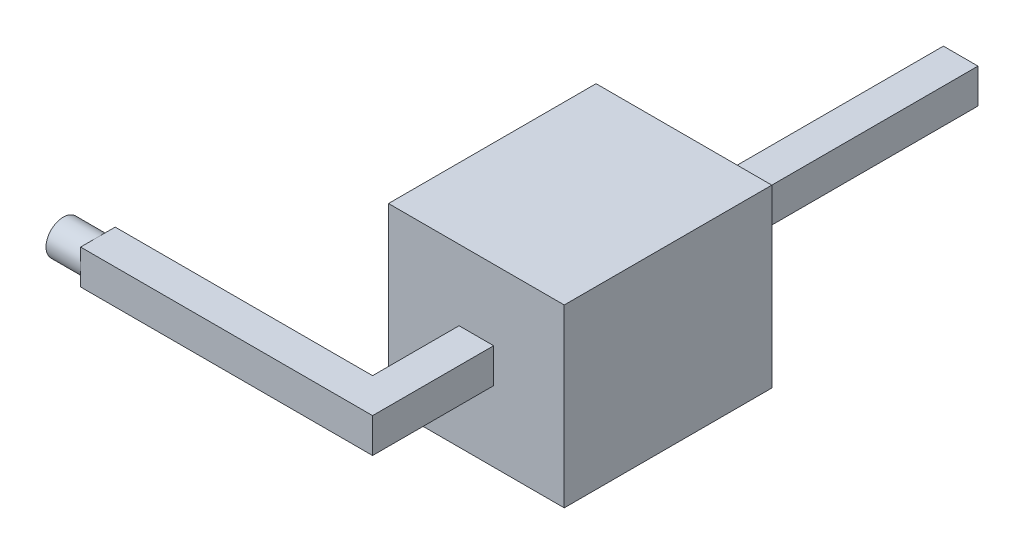
ISO-10303-21;
HEADER;
FILE_DESCRIPTION(('STEP AP214'),'2;1');
FILE_NAME('part.step','',(''),(''),'','','');
FILE_SCHEMA(('AUTOMOTIVE_DESIGN { 1 0 10303 214 1 1 1 1 }'));
ENDSEC;
DATA;
#1=APPLICATION_CONTEXT('core data for automotive mechanical design processes');
#2=APPLICATION_PROTOCOL_DEFINITION('international standard','automotive_design',2000,#1);
#3=PRODUCT_CONTEXT('',#1,'mechanical');
#4=PRODUCT('Part','Part','',(#3));
#5=PRODUCT_RELATED_PRODUCT_CATEGORY('part','',(#4));
#6=PRODUCT_DEFINITION_FORMATION('','',#4);
#7=PRODUCT_DEFINITION_CONTEXT('part definition',#1,'design');
#8=PRODUCT_DEFINITION('design','',#6,#7);
#9=PRODUCT_DEFINITION_SHAPE('','',#8);
#10=(LENGTH_UNIT() NAMED_UNIT(*) SI_UNIT(.MILLI.,.METRE.));
#11=(NAMED_UNIT(*) PLANE_ANGLE_UNIT() SI_UNIT($,.RADIAN.));
#12=(NAMED_UNIT(*) SI_UNIT($,.STERADIAN.) SOLID_ANGLE_UNIT());
#13=UNCERTAINTY_MEASURE_WITH_UNIT(LENGTH_MEASURE(1.E-05),#10,'distance_accuracy_value','');
#14=(GEOMETRIC_REPRESENTATION_CONTEXT(3) GLOBAL_UNCERTAINTY_ASSIGNED_CONTEXT((#13)) GLOBAL_UNIT_ASSIGNED_CONTEXT((#10,
#11,#12)) REPRESENTATION_CONTEXT('',''));
#15=CARTESIAN_POINT('',(0.,0.,0.));
#16=DIRECTION('',(0.,0.,1.));
#17=DIRECTION('',(1.,0.,0.));
#18=AXIS2_PLACEMENT_3D('',#15,#16,#17);
#19=CARTESIAN_POINT('',(0.,0.5,0.));
#20=DIRECTION('',(0.,-1.,0.));
#21=DIRECTION('',(0.,0.,-1.));
#22=AXIS2_PLACEMENT_3D('',#19,#20,#21);
#23=PLANE('',#22);
#24=DIRECTION('',(0.,0.,-1.));
#25=VECTOR('',#24,1.);
#26=CARTESIAN_POINT('',(0.5,0.5,0.));
#27=LINE('',#26,#25);
#28=CARTESIAN_POINT('',(0.5,0.5,0.));
#29=VERTEX_POINT('',#28);
#30=CARTESIAN_POINT('',(0.5,0.5,-0.25));
#31=VERTEX_POINT('',#30);
#32=EDGE_CURVE('E175',#29,#31,#27,.T.);
#33=ORIENTED_EDGE('',*,*,#32,.F.);
#34=DIRECTION('',(1.,0.,0.));
#35=VECTOR('',#34,1.);
#36=CARTESIAN_POINT('',(0.,0.5,0.));
#37=LINE('',#36,#35);
#38=CARTESIAN_POINT('',(4.72,0.5,0.));
#39=VERTEX_POINT('',#38);
#40=EDGE_CURVE('E180',#29,#39,#37,.T.);
#41=ORIENTED_EDGE('',*,*,#40,.T.);
#42=DIRECTION('',(0.,0.,-1.));
#43=VECTOR('',#42,1.);
#44=CARTESIAN_POINT('',(4.72,0.5,0.));
#45=LINE('',#44,#43);
#46=CARTESIAN_POINT('',(4.72,0.5,-1.75000000000002));
#47=VERTEX_POINT('',#46);
#48=EDGE_CURVE('E232',#39,#47,#45,.T.);
#49=ORIENTED_EDGE('',*,*,#48,.T.);
#50=DIRECTION('',(1.,0.,0.));
#51=VECTOR('',#50,1.);
#52=CARTESIAN_POINT('',(0.,0.5,-1.75));
#53=LINE('',#52,#51);
#54=CARTESIAN_POINT('',(4.22,0.5,-1.75000000000002));
#55=VERTEX_POINT('',#54);
#56=EDGE_CURVE('E226',#55,#47,#53,.T.);
#57=ORIENTED_EDGE('',*,*,#56,.F.);
#58=DIRECTION('',(0.,0.,1.));
#59=VECTOR('',#58,1.);
#60=CARTESIAN_POINT('',(4.22,0.5,-0.5));
#61=LINE('',#60,#59);
#62=CARTESIAN_POINT('',(4.22,0.5,-0.5));
#63=VERTEX_POINT('',#62);
#64=EDGE_CURVE('E237',#55,#63,#61,.T.);
#65=ORIENTED_EDGE('',*,*,#64,.T.);
#66=DIRECTION('',(-1.,0.,0.));
#67=VECTOR('',#66,1.);
#68=CARTESIAN_POINT('',(0.,0.5,-0.500000000000001));
#69=LINE('',#68,#67);
#70=CARTESIAN_POINT('',(0.5,0.5,-0.500000000000001));
#71=VERTEX_POINT('',#70);
#72=EDGE_CURVE('E240',#63,#71,#69,.T.);
#73=ORIENTED_EDGE('',*,*,#72,.T.);
#74=EDGE_CURVE('E181',#31,#71,#27,.T.);
#75=ORIENTED_EDGE('',*,*,#74,.F.);
#76=EDGE_LOOP('',(#33,#41,#49,#57,#65,#73,#75));
#77=FACE_BOUND('',#76,.T.);
#78=ADVANCED_FACE('F36',(#77),#23,.F.);
#79=CARTESIAN_POINT('',(0.,0.,0.));
#80=DIRECTION('',(0.,-1.,0.));
#81=DIRECTION('',(0.,0.,-1.));
#82=AXIS2_PLACEMENT_3D('',#79,#80,#81);
#83=PLANE('',#82);
#84=DIRECTION('',(1.,0.,0.));
#85=VECTOR('',#84,1.);
#86=CARTESIAN_POINT('',(0.,0.,0.));
#87=LINE('',#86,#85);
#88=CARTESIAN_POINT('',(0.5,0.,0.));
#89=VERTEX_POINT('',#88);
#90=CARTESIAN_POINT('',(4.72,0.,0.));
#91=VERTEX_POINT('',#90);
#92=EDGE_CURVE('E228',#89,#91,#87,.T.);
#93=ORIENTED_EDGE('',*,*,#92,.F.);
#94=DIRECTION('',(0.,0.,-1.));
#95=VECTOR('',#94,1.);
#96=CARTESIAN_POINT('',(0.5,0.,0.));
#97=LINE('',#96,#95);
#98=CARTESIAN_POINT('',(0.5,0.,-0.25));
#99=VERTEX_POINT('',#98);
#100=EDGE_CURVE('E158',#89,#99,#97,.T.);
#101=ORIENTED_EDGE('',*,*,#100,.T.);
#102=CARTESIAN_POINT('',(0.5,0.,-0.500000000000001));
#103=VERTEX_POINT('',#102);
#104=EDGE_CURVE('E176',#99,#103,#97,.T.);
#105=ORIENTED_EDGE('',*,*,#104,.T.);
#106=DIRECTION('',(-1.,0.,0.));
#107=VECTOR('',#106,1.);
#108=CARTESIAN_POINT('',(0.,0.,-0.500000000000001));
#109=LINE('',#108,#107);
#110=CARTESIAN_POINT('',(4.22,0.,-0.5));
#111=VERTEX_POINT('',#110);
#112=EDGE_CURVE('E231',#111,#103,#109,.T.);
#113=ORIENTED_EDGE('',*,*,#112,.F.);
#114=DIRECTION('',(0.,0.,1.));
#115=VECTOR('',#114,1.);
#116=CARTESIAN_POINT('',(4.22,0.,-0.5));
#117=LINE('',#116,#115);
#118=CARTESIAN_POINT('',(4.22,0.,-1.75000000000002));
#119=VERTEX_POINT('',#118);
#120=EDGE_CURVE('E251',#119,#111,#117,.T.);
#121=ORIENTED_EDGE('',*,*,#120,.F.);
#122=DIRECTION('',(1.,0.,0.));
#123=VECTOR('',#122,1.);
#124=CARTESIAN_POINT('',(0.,0.,-1.75));
#125=LINE('',#124,#123);
#126=CARTESIAN_POINT('',(4.72,0.,-1.75000000000001));
#127=VERTEX_POINT('',#126);
#128=EDGE_CURVE('E269',#119,#127,#125,.T.);
#129=ORIENTED_EDGE('',*,*,#128,.T.);
#130=DIRECTION('',(0.,0.,-1.));
#131=VECTOR('',#130,1.);
#132=CARTESIAN_POINT('',(4.72,0.,-3.64997651924631));
#133=LINE('',#132,#131);
#134=EDGE_CURVE('E246',#91,#127,#133,.T.);
#135=ORIENTED_EDGE('',*,*,#134,.F.);
#136=EDGE_LOOP('',(#93,#101,#105,#113,#121,#129,#135));
#137=FACE_BOUND('',#136,.T.);
#138=ADVANCED_FACE('F281',(#137),#83,.T.);
#139=CARTESIAN_POINT('',(0.,0.5,0.));
#140=DIRECTION('',(0.,0.,-1.));
#141=DIRECTION('',(-1.,0.,0.));
#142=AXIS2_PLACEMENT_3D('',#139,#140,#141);
#143=PLANE('',#142);
#144=DIRECTION('',(0.,1.,0.));
#145=VECTOR('',#144,1.);
#146=CARTESIAN_POINT('',(0.5,0.5,0.));
#147=LINE('',#146,#145);
#148=CARTESIAN_POINT('',(0.5,0.25,0.));
#149=VERTEX_POINT('',#148);
#150=EDGE_CURVE('E153',#89,#149,#147,.T.);
#151=ORIENTED_EDGE('',*,*,#150,.F.);
#152=ORIENTED_EDGE('',*,*,#92,.T.);
#153=DIRECTION('',(0.,-1.,0.));
#154=VECTOR('',#153,1.);
#155=CARTESIAN_POINT('',(4.72,0.5,0.));
#156=LINE('',#155,#154);
#157=EDGE_CURVE('E264',#39,#91,#156,.T.);
#158=ORIENTED_EDGE('',*,*,#157,.F.);
#159=ORIENTED_EDGE('',*,*,#40,.F.);
#160=EDGE_CURVE('E163',#149,#29,#147,.T.);
#161=ORIENTED_EDGE('',*,*,#160,.F.);
#162=EDGE_LOOP('',(#151,#152,#158,#159,#161));
#163=FACE_BOUND('',#162,.T.);
#164=ADVANCED_FACE('F178',(#163),#143,.F.);
#165=CARTESIAN_POINT('',(0.,0.5,-0.500000000000001));
#166=DIRECTION('',(0.,0.,1.));
#167=DIRECTION('',(1.,0.,0.));
#168=AXIS2_PLACEMENT_3D('',#165,#166,#167);
#169=PLANE('',#168);
#170=DIRECTION('',(0.,-1.,0.));
#171=VECTOR('',#170,1.);
#172=CARTESIAN_POINT('',(0.5,0.5,-0.500000000000001));
#173=LINE('',#172,#171);
#174=CARTESIAN_POINT('',(0.5,0.25,-0.5));
#175=VERTEX_POINT('',#174);
#176=EDGE_CURVE('E12',#71,#175,#173,.T.);
#177=ORIENTED_EDGE('',*,*,#176,.F.);
#178=ORIENTED_EDGE('',*,*,#72,.F.);
#179=DIRECTION('',(0.,-1.,0.));
#180=VECTOR('',#179,1.);
#181=CARTESIAN_POINT('',(4.22,0.5,-0.5));
#182=LINE('',#181,#180);
#183=EDGE_CURVE('E243',#63,#111,#182,.T.);
#184=ORIENTED_EDGE('',*,*,#183,.T.);
#185=ORIENTED_EDGE('',*,*,#112,.T.);
#186=EDGE_CURVE('E40',#175,#103,#173,.T.);
#187=ORIENTED_EDGE('',*,*,#186,.F.);
#188=EDGE_LOOP('',(#177,#178,#184,#185,#187));
#189=FACE_BOUND('',#188,.T.);
#190=ADVANCED_FACE('F282',(#189),#169,.F.);
#191=CARTESIAN_POINT('',(4.72,0.5,-3.64997651924631));
#192=DIRECTION('',(-1.,0.,0.));
#193=DIRECTION('',(0.,0.,1.));
#194=AXIS2_PLACEMENT_3D('',#191,#192,#193);
#195=PLANE('',#194);
#196=DIRECTION('',(0.,-1.,0.));
#197=VECTOR('',#196,1.);
#198=CARTESIAN_POINT('',(4.72,0.5,-1.75000000000002));
#199=LINE('',#198,#197);
#200=EDGE_CURVE('E224',#47,#127,#199,.T.);
#201=ORIENTED_EDGE('',*,*,#200,.F.);
#202=ORIENTED_EDGE('',*,*,#48,.F.);
#203=ORIENTED_EDGE('',*,*,#157,.T.);
#204=ORIENTED_EDGE('',*,*,#134,.T.);
#205=EDGE_LOOP('',(#201,#202,#203,#204));
#206=FACE_BOUND('',#205,.T.);
#207=ADVANCED_FACE('F296',(#206),#195,.F.);
#208=CARTESIAN_POINT('',(4.22,0.5,-0.5));
#209=DIRECTION('',(1.,0.,0.));
#210=DIRECTION('',(0.,0.,-1.));
#211=AXIS2_PLACEMENT_3D('',#208,#209,#210);
#212=PLANE('',#211);
#213=DIRECTION('',(0.,1.,0.));
#214=VECTOR('',#213,1.);
#215=CARTESIAN_POINT('',(4.22,0.5,-1.75000000000002));
#216=LINE('',#215,#214);
#217=EDGE_CURVE('E222',#119,#55,#216,.T.);
#218=ORIENTED_EDGE('',*,*,#217,.F.);
#219=ORIENTED_EDGE('',*,*,#120,.T.);
#220=ORIENTED_EDGE('',*,*,#183,.F.);
#221=ORIENTED_EDGE('',*,*,#64,.F.);
#222=EDGE_LOOP('',(#218,#219,#220,#221));
#223=FACE_BOUND('',#222,.T.);
#224=ADVANCED_FACE('F288',(#223),#212,.F.);
#225=CARTESIAN_POINT('',(0.,0.,-1.75));
#226=DIRECTION('',(0.,0.,-1.));
#227=DIRECTION('',(-1.,0.,0.));
#228=AXIS2_PLACEMENT_3D('',#225,#226,#227);
#229=PLANE('',#228);
#230=DIRECTION('',(0.,-1.,0.));
#231=VECTOR('',#230,1.);
#232=CARTESIAN_POINT('',(5.74000000000003,-1.02,-1.75000000000002));
#233=LINE('',#232,#231);
#234=CARTESIAN_POINT('',(5.74000000000003,1.52,-1.75000000000002));
#235=VERTEX_POINT('',#234);
#236=CARTESIAN_POINT('',(5.74000000000003,-1.02,-1.75000000000002));
#237=VERTEX_POINT('',#236);
#238=EDGE_CURVE('E185',#235,#237,#233,.T.);
#239=ORIENTED_EDGE('',*,*,#238,.F.);
#240=DIRECTION('',(1.,0.,0.));
#241=VECTOR('',#240,1.);
#242=CARTESIAN_POINT('',(3.20000000000003,1.52,-1.75000000000001));
#243=LINE('',#242,#241);
#244=CARTESIAN_POINT('',(3.20000000000003,1.52,-1.75000000000001));
#245=VERTEX_POINT('',#244);
#246=EDGE_CURVE('E195',#245,#235,#243,.T.);
#247=ORIENTED_EDGE('',*,*,#246,.F.);
#248=DIRECTION('',(0.,1.,0.));
#249=VECTOR('',#248,1.);
#250=CARTESIAN_POINT('',(3.20000000000003,-1.02,-1.75000000000001));
#251=LINE('',#250,#249);
#252=CARTESIAN_POINT('',(3.20000000000003,-1.02,-1.75000000000001));
#253=VERTEX_POINT('',#252);
#254=EDGE_CURVE('E192',#253,#245,#251,.T.);
#255=ORIENTED_EDGE('',*,*,#254,.F.);
#256=DIRECTION('',(-1.,0.,0.));
#257=VECTOR('',#256,1.);
#258=CARTESIAN_POINT('',(3.20000000000003,-1.02,-1.75000000000001));
#259=LINE('',#258,#257);
#260=EDGE_CURVE('E188',#237,#253,#259,.T.);
#261=ORIENTED_EDGE('',*,*,#260,.F.);
#262=EDGE_LOOP('',(#239,#247,#255,#261));
#263=FACE_BOUND('',#262,.T.);
#264=ORIENTED_EDGE('',*,*,#217,.T.);
#265=ORIENTED_EDGE('',*,*,#56,.T.);
#266=ORIENTED_EDGE('',*,*,#200,.T.);
#267=ORIENTED_EDGE('',*,*,#128,.F.);
#268=EDGE_LOOP('',(#264,#265,#266,#267));
#269=FACE_BOUND('',#268,.T.);
#270=ADVANCED_FACE('F291',(#263,#269),#229,.F.);
#271=CARTESIAN_POINT('',(0.,0.,-4.75));
#272=DIRECTION('',(0.,0.,-1.));
#273=DIRECTION('',(-1.,0.,0.));
#274=AXIS2_PLACEMENT_3D('',#271,#272,#273);
#275=PLANE('',#274);
#276=DIRECTION('',(0.,-1.,0.));
#277=VECTOR('',#276,1.);
#278=CARTESIAN_POINT('',(5.74000000000002,-1.02,-4.75000000000002));
#279=LINE('',#278,#277);
#280=CARTESIAN_POINT('',(5.74000000000002,1.52,-4.75000000000002));
#281=VERTEX_POINT('',#280);
#282=CARTESIAN_POINT('',(5.74000000000002,-1.02,-4.75000000000002));
#283=VERTEX_POINT('',#282);
#284=EDGE_CURVE('E162',#281,#283,#279,.T.);
#285=ORIENTED_EDGE('',*,*,#284,.T.);
#286=DIRECTION('',(-1.,0.,0.));
#287=VECTOR('',#286,1.);
#288=CARTESIAN_POINT('',(3.20000000000001,-1.02,-4.75000000000001));
#289=LINE('',#288,#287);
#290=CARTESIAN_POINT('',(3.20000000000001,-1.02,-4.75000000000001));
#291=VERTEX_POINT('',#290);
#292=EDGE_CURVE('E201',#283,#291,#289,.T.);
#293=ORIENTED_EDGE('',*,*,#292,.T.);
#294=DIRECTION('',(0.,1.,0.));
#295=VECTOR('',#294,1.);
#296=CARTESIAN_POINT('',(3.20000000000001,-1.02,-4.75000000000001));
#297=LINE('',#296,#295);
#298=CARTESIAN_POINT('',(3.20000000000001,1.52,-4.75000000000001));
#299=VERTEX_POINT('',#298);
#300=EDGE_CURVE('E204',#291,#299,#297,.T.);
#301=ORIENTED_EDGE('',*,*,#300,.T.);
#302=DIRECTION('',(1.,0.,0.));
#303=VECTOR('',#302,1.);
#304=CARTESIAN_POINT('',(3.20000000000001,1.52,-4.75000000000001));
#305=LINE('',#304,#303);
#306=EDGE_CURVE('E189',#299,#281,#305,.T.);
#307=ORIENTED_EDGE('',*,*,#306,.T.);
#308=EDGE_LOOP('',(#285,#293,#301,#307));
#309=FACE_BOUND('',#308,.T.);
#310=DIRECTION('',(1.,0.,0.));
#311=VECTOR('',#310,1.);
#312=CARTESIAN_POINT('',(0.,0.5,-4.75));
#313=LINE('',#312,#311);
#314=CARTESIAN_POINT('',(4.22,0.5,-4.75000000000001));
#315=VERTEX_POINT('',#314);
#316=CARTESIAN_POINT('',(4.72,0.5,-4.75000000000001));
#317=VERTEX_POINT('',#316);
#318=EDGE_CURVE('E220',#315,#317,#313,.T.);
#319=ORIENTED_EDGE('',*,*,#318,.F.);
#320=DIRECTION('',(0.,1.,0.));
#321=VECTOR('',#320,1.);
#322=CARTESIAN_POINT('',(4.22,0.5,-4.75000000000002));
#323=LINE('',#322,#321);
#324=CARTESIAN_POINT('',(4.22,0.,-4.75000000000001));
#325=VERTEX_POINT('',#324);
#326=EDGE_CURVE('E59',#325,#315,#323,.T.);
#327=ORIENTED_EDGE('',*,*,#326,.F.);
#328=DIRECTION('',(1.,0.,0.));
#329=VECTOR('',#328,1.);
#330=CARTESIAN_POINT('',(0.,0.,-4.75));
#331=LINE('',#330,#329);
#332=CARTESIAN_POINT('',(4.72,0.,-4.75000000000002));
#333=VERTEX_POINT('',#332);
#334=EDGE_CURVE('E267',#325,#333,#331,.T.);
#335=ORIENTED_EDGE('',*,*,#334,.T.);
#336=DIRECTION('',(0.,-1.,0.));
#337=VECTOR('',#336,1.);
#338=CARTESIAN_POINT('',(4.72,0.5,-4.75000000000002));
#339=LINE('',#338,#337);
#340=EDGE_CURVE('E217',#317,#333,#339,.T.);
#341=ORIENTED_EDGE('',*,*,#340,.F.);
#342=EDGE_LOOP('',(#319,#327,#335,#341));
#343=FACE_BOUND('',#342,.T.);
#344=ADVANCED_FACE('F336',(#309,#343),#275,.T.);
#345=CARTESIAN_POINT('',(5.74000000000003,-1.02,-1.75000000000002));
#346=DIRECTION('',(1.,0.,0.));
#347=DIRECTION('',(0.,0.,-1.));
#348=AXIS2_PLACEMENT_3D('',#345,#346,#347);
#349=PLANE('',#348);
#350=ORIENTED_EDGE('',*,*,#284,.F.);
#351=DIRECTION('',(0.,0.,-1.));
#352=VECTOR('',#351,1.);
#353=CARTESIAN_POINT('',(5.74000000000003,1.52,-1.75000000000002));
#354=LINE('',#353,#352);
#355=EDGE_CURVE('E209',#235,#281,#354,.T.);
#356=ORIENTED_EDGE('',*,*,#355,.F.);
#357=ORIENTED_EDGE('',*,*,#238,.T.);
#358=DIRECTION('',(0.,0.,-1.));
#359=VECTOR('',#358,1.);
#360=CARTESIAN_POINT('',(5.74000000000003,-1.02,-1.75000000000002));
#361=LINE('',#360,#359);
#362=EDGE_CURVE('E198',#237,#283,#361,.T.);
#363=ORIENTED_EDGE('',*,*,#362,.T.);
#364=EDGE_LOOP('',(#350,#356,#357,#363));
#365=FACE_BOUND('',#364,.T.);
#366=ADVANCED_FACE('F428',(#365),#349,.T.);
#367=CARTESIAN_POINT('',(3.20000000000003,1.52,-1.75000000000001));
#368=DIRECTION('',(0.,1.,0.));
#369=DIRECTION('',(-1.,0.,0.));
#370=AXIS2_PLACEMENT_3D('',#367,#368,#369);
#371=PLANE('',#370);
#372=ORIENTED_EDGE('',*,*,#306,.F.);
#373=DIRECTION('',(0.,0.,-1.));
#374=VECTOR('',#373,1.);
#375=CARTESIAN_POINT('',(3.20000000000003,1.52,-1.75000000000001));
#376=LINE('',#375,#374);
#377=EDGE_CURVE('E211',#245,#299,#376,.T.);
#378=ORIENTED_EDGE('',*,*,#377,.F.);
#379=ORIENTED_EDGE('',*,*,#246,.T.);
#380=ORIENTED_EDGE('',*,*,#355,.T.);
#381=EDGE_LOOP('',(#372,#378,#379,#380));
#382=FACE_BOUND('',#381,.T.);
#383=ADVANCED_FACE('F430',(#382),#371,.T.);
#384=CARTESIAN_POINT('',(3.20000000000003,-1.02,-1.75000000000001));
#385=DIRECTION('',(-1.,0.,0.));
#386=DIRECTION('',(0.,0.,1.));
#387=AXIS2_PLACEMENT_3D('',#384,#385,#386);
#388=PLANE('',#387);
#389=ORIENTED_EDGE('',*,*,#300,.F.);
#390=DIRECTION('',(0.,0.,-1.));
#391=VECTOR('',#390,1.);
#392=CARTESIAN_POINT('',(3.20000000000003,-1.02,-1.75000000000001));
#393=LINE('',#392,#391);
#394=EDGE_CURVE('E213',#253,#291,#393,.T.);
#395=ORIENTED_EDGE('',*,*,#394,.F.);
#396=ORIENTED_EDGE('',*,*,#254,.T.);
#397=ORIENTED_EDGE('',*,*,#377,.T.);
#398=EDGE_LOOP('',(#389,#395,#396,#397));
#399=FACE_BOUND('',#398,.T.);
#400=ADVANCED_FACE('F433',(#399),#388,.T.);
#401=CARTESIAN_POINT('',(3.20000000000003,-1.02,-1.75000000000001));
#402=DIRECTION('',(0.,-1.,0.));
#403=DIRECTION('',(1.,0.,0.));
#404=AXIS2_PLACEMENT_3D('',#401,#402,#403);
#405=PLANE('',#404);
#406=ORIENTED_EDGE('',*,*,#292,.F.);
#407=ORIENTED_EDGE('',*,*,#362,.F.);
#408=ORIENTED_EDGE('',*,*,#260,.T.);
#409=ORIENTED_EDGE('',*,*,#394,.T.);
#410=EDGE_LOOP('',(#406,#407,#408,#409));
#411=FACE_BOUND('',#410,.T.);
#412=ADVANCED_FACE('F328',(#411),#405,.T.);
#413=CARTESIAN_POINT('',(4.72,0.5,-8.75));
#414=DIRECTION('',(0.,0.,1.));
#415=DIRECTION('',(1.,0.,0.));
#416=AXIS2_PLACEMENT_3D('',#413,#414,#415);
#417=PLANE('',#416);
#418=DIRECTION('',(-1.,0.,0.));
#419=VECTOR('',#418,1.);
#420=CARTESIAN_POINT('',(4.72,0.,-8.75));
#421=LINE('',#420,#419);
#422=CARTESIAN_POINT('',(4.72,0.,-8.75));
#423=VERTEX_POINT('',#422);
#424=CARTESIAN_POINT('',(4.22,0.,-8.75));
#425=VERTEX_POINT('',#424);
#426=EDGE_CURVE('E249',#423,#425,#421,.T.);
#427=ORIENTED_EDGE('',*,*,#426,.T.);
#428=DIRECTION('',(0.,-1.,0.));
#429=VECTOR('',#428,1.);
#430=CARTESIAN_POINT('',(4.22,0.5,-8.75));
#431=LINE('',#430,#429);
#432=CARTESIAN_POINT('',(4.22,0.5,-8.75));
#433=VERTEX_POINT('',#432);
#434=EDGE_CURVE('E258',#433,#425,#431,.T.);
#435=ORIENTED_EDGE('',*,*,#434,.F.);
#436=DIRECTION('',(-1.,0.,0.));
#437=VECTOR('',#436,1.);
#438=CARTESIAN_POINT('',(4.72,0.5,-8.75));
#439=LINE('',#438,#437);
#440=CARTESIAN_POINT('',(4.72,0.5,-8.75));
#441=VERTEX_POINT('',#440);
#442=EDGE_CURVE('E235',#441,#433,#439,.T.);
#443=ORIENTED_EDGE('',*,*,#442,.F.);
#444=DIRECTION('',(0.,-1.,0.));
#445=VECTOR('',#444,1.);
#446=CARTESIAN_POINT('',(4.72,0.5,-8.75));
#447=LINE('',#446,#445);
#448=EDGE_CURVE('E261',#441,#423,#447,.T.);
#449=ORIENTED_EDGE('',*,*,#448,.T.);
#450=EDGE_LOOP('',(#427,#435,#443,#449));
#451=FACE_BOUND('',#450,.T.);
#452=ADVANCED_FACE('F321',(#451),#417,.F.);
#453=EDGE_CURVE('E238',#433,#315,#61,.T.);
#454=ORIENTED_EDGE('',*,*,#453,.T.);
#455=ORIENTED_EDGE('',*,*,#318,.T.);
#456=EDGE_CURVE('E230',#317,#441,#45,.T.);
#457=ORIENTED_EDGE('',*,*,#456,.T.);
#458=ORIENTED_EDGE('',*,*,#442,.T.);
#459=EDGE_LOOP('',(#454,#455,#457,#458));
#460=FACE_BOUND('',#459,.T.);
#461=ADVANCED_FACE('F312',(#460),#23,.F.);
#462=ORIENTED_EDGE('',*,*,#334,.F.);
#463=EDGE_CURVE('E252',#425,#325,#117,.T.);
#464=ORIENTED_EDGE('',*,*,#463,.F.);
#465=ORIENTED_EDGE('',*,*,#426,.F.);
#466=EDGE_CURVE('E245',#333,#423,#133,.T.);
#467=ORIENTED_EDGE('',*,*,#466,.F.);
#468=EDGE_LOOP('',(#462,#464,#465,#467));
#469=FACE_BOUND('',#468,.T.);
#470=ADVANCED_FACE('F318',(#469),#83,.T.);
#471=ORIENTED_EDGE('',*,*,#463,.T.);
#472=ORIENTED_EDGE('',*,*,#326,.T.);
#473=ORIENTED_EDGE('',*,*,#453,.F.);
#474=ORIENTED_EDGE('',*,*,#434,.T.);
#475=EDGE_LOOP('',(#471,#472,#473,#474));
#476=FACE_BOUND('',#475,.T.);
#477=ADVANCED_FACE('F304',(#476),#212,.F.);
#478=ORIENTED_EDGE('',*,*,#456,.F.);
#479=ORIENTED_EDGE('',*,*,#340,.T.);
#480=ORIENTED_EDGE('',*,*,#466,.T.);
#481=ORIENTED_EDGE('',*,*,#448,.F.);
#482=EDGE_LOOP('',(#478,#479,#480,#481));
#483=FACE_BOUND('',#482,.T.);
#484=ADVANCED_FACE('F299',(#483),#195,.F.);
#485=CARTESIAN_POINT('',(0.5,0.25,-4.375));
#486=DIRECTION('',(-1.,0.,0.));
#487=DIRECTION('',(0.,0.,1.));
#488=AXIS2_PLACEMENT_3D('',#485,#486,#487);
#489=PLANE('',#488);
#490=ORIENTED_EDGE('',*,*,#150,.T.);
#491=CARTESIAN_POINT('',(0.5,0.25,-0.25));
#492=DIRECTION('',(-1.,0.,0.));
#493=DIRECTION('',(0.,0.,1.));
#494=AXIS2_PLACEMENT_3D('',#491,#492,#493);
#495=CIRCLE('',#494,0.25);
#496=EDGE_CURVE('E156',#99,#149,#495,.T.);
#497=ORIENTED_EDGE('',*,*,#496,.F.);
#498=ORIENTED_EDGE('',*,*,#100,.F.);
#499=EDGE_LOOP('',(#490,#497,#498));
#500=FACE_BOUND('',#499,.T.);
#501=ADVANCED_FACE('F155',(#500),#489,.T.);
#502=ORIENTED_EDGE('',*,*,#160,.T.);
#503=ORIENTED_EDGE('',*,*,#32,.T.);
#504=EDGE_CURVE('E167',#149,#31,#495,.T.);
#505=ORIENTED_EDGE('',*,*,#504,.F.);
#506=EDGE_LOOP('',(#502,#503,#505));
#507=FACE_BOUND('',#506,.T.);
#508=ADVANCED_FACE('F173',(#507),#489,.T.);
#509=ORIENTED_EDGE('',*,*,#74,.T.);
#510=ORIENTED_EDGE('',*,*,#176,.T.);
#511=EDGE_CURVE('E51',#31,#175,#495,.T.);
#512=ORIENTED_EDGE('',*,*,#511,.F.);
#513=EDGE_LOOP('',(#509,#510,#512));
#514=FACE_BOUND('',#513,.T.);
#515=ADVANCED_FACE('F393',(#514),#489,.T.);
#516=CARTESIAN_POINT('',(0.5,0.25,-0.25));
#517=DIRECTION('',(-1.,0.,0.));
#518=DIRECTION('',(0.,0.,1.));
#519=AXIS2_PLACEMENT_3D('',#516,#517,#518);
#520=CYLINDRICAL_SURFACE('',#519,0.25);
#521=CARTESIAN_POINT('',(0.,0.25,-0.25));
#522=DIRECTION('',(-1.,0.,0.));
#523=DIRECTION('',(0.,0.,1.));
#524=AXIS2_PLACEMENT_3D('',#521,#522,#523);
#525=CIRCLE('',#524,0.25);
#526=CARTESIAN_POINT('',(0.,0.25,0.));
#527=VERTEX_POINT('',#526);
#528=EDGE_CURVE('E170',#527,#527,#525,.T.);
#529=ORIENTED_EDGE('',*,*,#528,.F.);
#530=EDGE_LOOP('',(#529));
#531=FACE_BOUND('',#530,.T.);
#532=ORIENTED_EDGE('',*,*,#504,.T.);
#533=ORIENTED_EDGE('',*,*,#511,.T.);
#534=EDGE_CURVE('E169',#175,#99,#495,.T.);
#535=ORIENTED_EDGE('',*,*,#534,.T.);
#536=ORIENTED_EDGE('',*,*,#496,.T.);
#537=EDGE_LOOP('',(#532,#533,#535,#536));
#538=FACE_BOUND('',#537,.T.);
#539=ADVANCED_FACE('F166',(#531,#538),#520,.T.);
#540=ORIENTED_EDGE('',*,*,#534,.F.);
#541=ORIENTED_EDGE('',*,*,#186,.T.);
#542=ORIENTED_EDGE('',*,*,#104,.F.);
#543=EDGE_LOOP('',(#540,#541,#542));
#544=FACE_BOUND('',#543,.T.);
#545=ADVANCED_FACE('F277',(#544),#489,.T.);
#546=CARTESIAN_POINT('',(0.,0.5,0.));
#547=DIRECTION('',(1.,0.,0.));
#548=DIRECTION('',(0.,0.,-1.));
#549=AXIS2_PLACEMENT_3D('',#546,#547,#548);
#550=PLANE('',#549);
#551=ORIENTED_EDGE('',*,*,#528,.T.);
#552=EDGE_LOOP('',(#551));
#553=FACE_BOUND('',#552,.T.);
#554=ADVANCED_FACE('F38',(#553),#550,.F.);
#555=CLOSED_SHELL('',(#78,#138,#164,#190,#207,#224,#270,#344,#366,#383,#400,#412,#452,#461,#470,
#477,#484,#501,#508,#515,#539,#545,#554));
#556=MANIFOLD_SOLID_BREP('B2',#555);
#557=ADVANCED_BREP_SHAPE_REPRESENTATION('',(#18,#556),#14);
#558=SHAPE_DEFINITION_REPRESENTATION(#9,#557);
ENDSEC;
END-ISO-10303-21;
